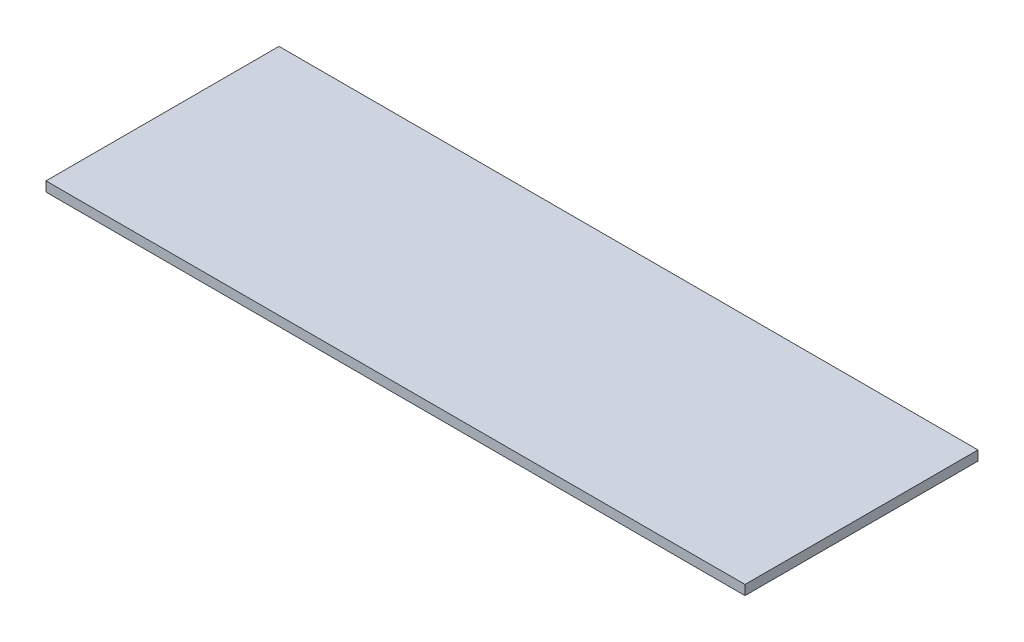
ISO-10303-21;
HEADER;
FILE_DESCRIPTION(('STEP AP214'),'2;1');
FILE_NAME('part.step','',(''),(''),'','','');
FILE_SCHEMA(('AUTOMOTIVE_DESIGN { 1 0 10303 214 1 1 1 1 }'));
ENDSEC;
DATA;
#1=APPLICATION_CONTEXT('core data for automotive mechanical design processes');
#2=APPLICATION_PROTOCOL_DEFINITION('international standard','automotive_design',2000,#1);
#3=PRODUCT_CONTEXT('',#1,'mechanical');
#4=PRODUCT('Part','Part','',(#3));
#5=PRODUCT_RELATED_PRODUCT_CATEGORY('part','',(#4));
#6=PRODUCT_DEFINITION_FORMATION('','',#4);
#7=PRODUCT_DEFINITION_CONTEXT('part definition',#1,'design');
#8=PRODUCT_DEFINITION('design','',#6,#7);
#9=PRODUCT_DEFINITION_SHAPE('','',#8);
#10=(LENGTH_UNIT() NAMED_UNIT(*) SI_UNIT(.MILLI.,.METRE.));
#11=(NAMED_UNIT(*) PLANE_ANGLE_UNIT() SI_UNIT($,.RADIAN.));
#12=(NAMED_UNIT(*) SI_UNIT($,.STERADIAN.) SOLID_ANGLE_UNIT());
#13=UNCERTAINTY_MEASURE_WITH_UNIT(LENGTH_MEASURE(1.E-05),#10,'distance_accuracy_value','');
#14=(GEOMETRIC_REPRESENTATION_CONTEXT(3) GLOBAL_UNCERTAINTY_ASSIGNED_CONTEXT((#13)) GLOBAL_UNIT_ASSIGNED_CONTEXT((#10,
#11,#12)) REPRESENTATION_CONTEXT('',''));
#15=CARTESIAN_POINT('',(0.,0.,0.));
#16=DIRECTION('',(0.,0.,1.));
#17=DIRECTION('',(1.,0.,0.));
#18=AXIS2_PLACEMENT_3D('',#15,#16,#17);
#19=CARTESIAN_POINT('',(905.341689833692,25.,-323.645305113999));
#20=DIRECTION('',(-1.,0.,0.));
#21=DIRECTION('',(0.,0.,1.));
#22=AXIS2_PLACEMENT_3D('',#19,#20,#21);
#23=PLANE('',#22);
#24=DIRECTION('',(0.,0.,-1.));
#25=VECTOR('',#24,1.);
#26=CARTESIAN_POINT('',(905.341689833692,0.,-323.645305113999));
#27=LINE('',#26,#25);
#28=CARTESIAN_POINT('',(905.341689833692,0.,276.354694886001));
#29=VERTEX_POINT('',#28);
#30=CARTESIAN_POINT('',(905.341689833692,0.,-323.645305113999));
#31=VERTEX_POINT('',#30);
#32=EDGE_CURVE('E103',#29,#31,#27,.T.);
#33=ORIENTED_EDGE('',*,*,#32,.T.);
#34=DIRECTION('',(0.,-1.,0.));
#35=VECTOR('',#34,1.);
#36=CARTESIAN_POINT('',(905.341689833692,25.,-323.645305113999));
#37=LINE('',#36,#35);
#38=CARTESIAN_POINT('',(905.341689833692,25.,-323.645305113999));
#39=VERTEX_POINT('',#38);
#40=EDGE_CURVE('E11',#39,#31,#37,.T.);
#41=ORIENTED_EDGE('',*,*,#40,.F.);
#42=DIRECTION('',(0.,0.,-1.));
#43=VECTOR('',#42,1.);
#44=CARTESIAN_POINT('',(905.341689833692,25.,-323.645305113999));
#45=LINE('',#44,#43);
#46=CARTESIAN_POINT('',(905.341689833692,25.,276.354694886001));
#47=VERTEX_POINT('',#46);
#48=EDGE_CURVE('E91',#47,#39,#45,.T.);
#49=ORIENTED_EDGE('',*,*,#48,.F.);
#50=DIRECTION('',(0.,-1.,0.));
#51=VECTOR('',#50,1.);
#52=CARTESIAN_POINT('',(905.341689833692,25.,276.354694886001));
#53=LINE('',#52,#51);
#54=EDGE_CURVE('E99',#47,#29,#53,.T.);
#55=ORIENTED_EDGE('',*,*,#54,.T.);
#56=EDGE_LOOP('',(#33,#41,#49,#55));
#57=FACE_BOUND('',#56,.T.);
#58=ADVANCED_FACE('F40',(#57),#23,.F.);
#59=CARTESIAN_POINT('',(905.341689833692,25.,-323.645305113999));
#60=DIRECTION('',(0.,0.,1.));
#61=DIRECTION('',(1.,0.,0.));
#62=AXIS2_PLACEMENT_3D('',#59,#60,#61);
#63=PLANE('',#62);
#64=DIRECTION('',(-1.,0.,0.));
#65=VECTOR('',#64,1.);
#66=CARTESIAN_POINT('',(905.341689833692,0.,-323.645305113999));
#67=LINE('',#66,#65);
#68=CARTESIAN_POINT('',(-894.658310166308,0.,-323.645305113999));
#69=VERTEX_POINT('',#68);
#70=EDGE_CURVE('E95',#31,#69,#67,.T.);
#71=ORIENTED_EDGE('',*,*,#70,.T.);
#72=DIRECTION('',(0.,-1.,0.));
#73=VECTOR('',#72,1.);
#74=CARTESIAN_POINT('',(-894.658310166308,25.,-323.645305113999));
#75=LINE('',#74,#73);
#76=CARTESIAN_POINT('',(-894.658310166308,25.,-323.645305113999));
#77=VERTEX_POINT('',#76);
#78=EDGE_CURVE('E48',#77,#69,#75,.T.);
#79=ORIENTED_EDGE('',*,*,#78,.F.);
#80=DIRECTION('',(-1.,0.,0.));
#81=VECTOR('',#80,1.);
#82=CARTESIAN_POINT('',(905.341689833692,25.,-323.645305113999));
#83=LINE('',#82,#81);
#84=EDGE_CURVE('E86',#39,#77,#83,.T.);
#85=ORIENTED_EDGE('',*,*,#84,.F.);
#86=ORIENTED_EDGE('',*,*,#40,.T.);
#87=EDGE_LOOP('',(#71,#79,#85,#86));
#88=FACE_BOUND('',#87,.T.);
#89=ADVANCED_FACE('F94',(#88),#63,.F.);
#90=CARTESIAN_POINT('',(-894.658310166308,25.,-323.645305113999));
#91=DIRECTION('',(1.,0.,0.));
#92=DIRECTION('',(0.,0.,-1.));
#93=AXIS2_PLACEMENT_3D('',#90,#91,#92);
#94=PLANE('',#93);
#95=DIRECTION('',(0.,0.,1.));
#96=VECTOR('',#95,1.);
#97=CARTESIAN_POINT('',(-894.658310166308,0.,-323.645305113999));
#98=LINE('',#97,#96);
#99=CARTESIAN_POINT('',(-894.658310166308,0.,276.354694886001));
#100=VERTEX_POINT('',#99);
#101=EDGE_CURVE('E73',#69,#100,#98,.T.);
#102=ORIENTED_EDGE('',*,*,#101,.T.);
#103=DIRECTION('',(0.,-1.,0.));
#104=VECTOR('',#103,1.);
#105=CARTESIAN_POINT('',(-894.658310166308,25.,276.354694886001));
#106=LINE('',#105,#104);
#107=CARTESIAN_POINT('',(-894.658310166308,25.,276.354694886001));
#108=VERTEX_POINT('',#107);
#109=EDGE_CURVE('E96',#108,#100,#106,.T.);
#110=ORIENTED_EDGE('',*,*,#109,.F.);
#111=DIRECTION('',(0.,0.,1.));
#112=VECTOR('',#111,1.);
#113=CARTESIAN_POINT('',(-894.658310166308,25.,-323.645305113999));
#114=LINE('',#113,#112);
#115=EDGE_CURVE('E89',#77,#108,#114,.T.);
#116=ORIENTED_EDGE('',*,*,#115,.F.);
#117=ORIENTED_EDGE('',*,*,#78,.T.);
#118=EDGE_LOOP('',(#102,#110,#116,#117));
#119=FACE_BOUND('',#118,.T.);
#120=ADVANCED_FACE('F97',(#119),#94,.F.);
#121=CARTESIAN_POINT('',(905.341689833692,25.,276.354694886001));
#122=DIRECTION('',(0.,0.,-1.));
#123=DIRECTION('',(-1.,0.,0.));
#124=AXIS2_PLACEMENT_3D('',#121,#122,#123);
#125=PLANE('',#124);
#126=DIRECTION('',(1.,0.,0.));
#127=VECTOR('',#126,1.);
#128=CARTESIAN_POINT('',(905.341689833692,0.,276.354694886001));
#129=LINE('',#128,#127);
#130=EDGE_CURVE('E79',#100,#29,#129,.T.);
#131=ORIENTED_EDGE('',*,*,#130,.T.);
#132=ORIENTED_EDGE('',*,*,#54,.F.);
#133=DIRECTION('',(1.,0.,0.));
#134=VECTOR('',#133,1.);
#135=CARTESIAN_POINT('',(905.341689833692,25.,276.354694886001));
#136=LINE('',#135,#134);
#137=EDGE_CURVE('E56',#108,#47,#136,.T.);
#138=ORIENTED_EDGE('',*,*,#137,.F.);
#139=ORIENTED_EDGE('',*,*,#109,.T.);
#140=EDGE_LOOP('',(#131,#132,#138,#139));
#141=FACE_BOUND('',#140,.T.);
#142=ADVANCED_FACE('F110',(#141),#125,.F.);
#143=CARTESIAN_POINT('',(0.,25.,0.));
#144=DIRECTION('',(0.,-1.,0.));
#145=DIRECTION('',(0.,0.,-1.));
#146=AXIS2_PLACEMENT_3D('',#143,#144,#145);
#147=PLANE('',#146);
#148=ORIENTED_EDGE('',*,*,#48,.T.);
#149=ORIENTED_EDGE('',*,*,#84,.T.);
#150=ORIENTED_EDGE('',*,*,#115,.T.);
#151=ORIENTED_EDGE('',*,*,#137,.T.);
#152=EDGE_LOOP('',(#148,#149,#150,#151));
#153=FACE_BOUND('',#152,.T.);
#154=ADVANCED_FACE('F87',(#153),#147,.F.);
#155=CARTESIAN_POINT('',(0.,0.,0.));
#156=DIRECTION('',(0.,-1.,0.));
#157=DIRECTION('',(0.,0.,-1.));
#158=AXIS2_PLACEMENT_3D('',#155,#156,#157);
#159=PLANE('',#158);
#160=ORIENTED_EDGE('',*,*,#32,.F.);
#161=ORIENTED_EDGE('',*,*,#130,.F.);
#162=ORIENTED_EDGE('',*,*,#101,.F.);
#163=ORIENTED_EDGE('',*,*,#70,.F.);
#164=EDGE_LOOP('',(#160,#161,#162,#163));
#165=FACE_BOUND('',#164,.T.);
#166=ADVANCED_FACE('F113',(#165),#159,.T.);
#167=CLOSED_SHELL('',(#58,#89,#120,#142,#154,#166));
#168=MANIFOLD_SOLID_BREP('B2',#167);
#169=ADVANCED_BREP_SHAPE_REPRESENTATION('',(#18,#168),#14);
#170=SHAPE_DEFINITION_REPRESENTATION(#9,#169);
ENDSEC;
END-ISO-10303-21;
